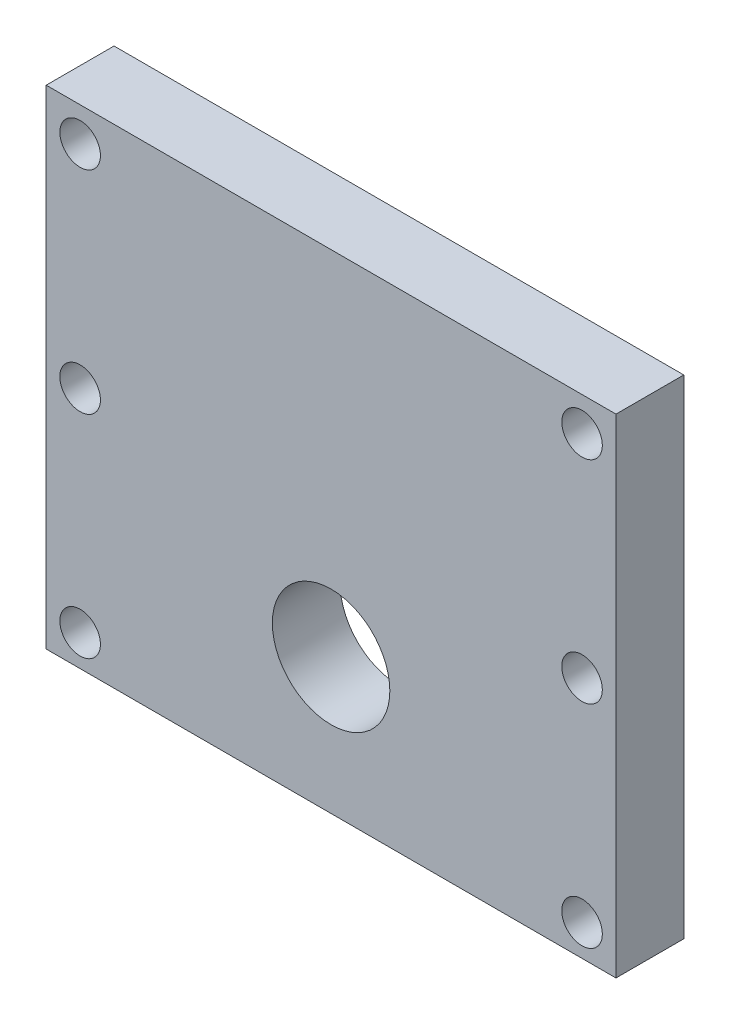
ISO-10303-21;
HEADER;
FILE_DESCRIPTION(('STEP AP214'),'2;1');
FILE_NAME('part.step','',(''),(''),'','','');
FILE_SCHEMA(('AUTOMOTIVE_DESIGN { 1 0 10303 214 1 1 1 1 }'));
ENDSEC;
DATA;
#1=APPLICATION_CONTEXT('core data for automotive mechanical design processes');
#2=APPLICATION_PROTOCOL_DEFINITION('international standard','automotive_design',2000,#1);
#3=PRODUCT_CONTEXT('',#1,'mechanical');
#4=PRODUCT('Part','Part','',(#3));
#5=PRODUCT_RELATED_PRODUCT_CATEGORY('part','',(#4));
#6=PRODUCT_DEFINITION_FORMATION('','',#4);
#7=PRODUCT_DEFINITION_CONTEXT('part definition',#1,'design');
#8=PRODUCT_DEFINITION('design','',#6,#7);
#9=PRODUCT_DEFINITION_SHAPE('','',#8);
#10=(LENGTH_UNIT() NAMED_UNIT(*) SI_UNIT(.MILLI.,.METRE.));
#11=(NAMED_UNIT(*) PLANE_ANGLE_UNIT() SI_UNIT($,.RADIAN.));
#12=(NAMED_UNIT(*) SI_UNIT($,.STERADIAN.) SOLID_ANGLE_UNIT());
#13=UNCERTAINTY_MEASURE_WITH_UNIT(LENGTH_MEASURE(1.E-05),#10,'distance_accuracy_value','');
#14=(GEOMETRIC_REPRESENTATION_CONTEXT(3) GLOBAL_UNCERTAINTY_ASSIGNED_CONTEXT((#13)) GLOBAL_UNIT_ASSIGNED_CONTEXT((#10,
#11,#12)) REPRESENTATION_CONTEXT('',''));
#15=CARTESIAN_POINT('',(0.,0.,0.));
#16=DIRECTION('',(0.,0.,1.));
#17=DIRECTION('',(1.,0.,0.));
#18=AXIS2_PLACEMENT_3D('',#15,#16,#17);
#19=CARTESIAN_POINT('',(0.,0.,6.35));
#20=DIRECTION('',(1.,0.,0.));
#21=DIRECTION('',(0.,0.,-1.));
#22=AXIS2_PLACEMENT_3D('',#19,#20,#21);
#23=PLANE('',#22);
#24=DIRECTION('',(0.,-1.,0.));
#25=VECTOR('',#24,1.);
#26=CARTESIAN_POINT('',(0.,0.,0.));
#27=LINE('',#26,#25);
#28=CARTESIAN_POINT('',(0.,45.72,0.));
#29=VERTEX_POINT('',#28);
#30=CARTESIAN_POINT('',(0.,0.,0.));
#31=VERTEX_POINT('',#30);
#32=EDGE_CURVE('E109',#29,#31,#27,.T.);
#33=ORIENTED_EDGE('',*,*,#32,.T.);
#34=DIRECTION('',(0.,0.,-1.));
#35=VECTOR('',#34,1.);
#36=CARTESIAN_POINT('',(0.,0.,6.35));
#37=LINE('',#36,#35);
#38=CARTESIAN_POINT('',(0.,0.,6.35));
#39=VERTEX_POINT('',#38);
#40=EDGE_CURVE('E11',#39,#31,#37,.T.);
#41=ORIENTED_EDGE('',*,*,#40,.F.);
#42=DIRECTION('',(0.,-1.,0.));
#43=VECTOR('',#42,1.);
#44=CARTESIAN_POINT('',(0.,0.,6.35));
#45=LINE('',#44,#43);
#46=CARTESIAN_POINT('',(0.,45.72,6.35));
#47=VERTEX_POINT('',#46);
#48=EDGE_CURVE('E95',#47,#39,#45,.T.);
#49=ORIENTED_EDGE('',*,*,#48,.F.);
#50=DIRECTION('',(0.,0.,-1.));
#51=VECTOR('',#50,1.);
#52=CARTESIAN_POINT('',(0.,45.72,6.35));
#53=LINE('',#52,#51);
#54=EDGE_CURVE('E105',#47,#29,#53,.T.);
#55=ORIENTED_EDGE('',*,*,#54,.T.);
#56=EDGE_LOOP('',(#33,#41,#49,#55));
#57=FACE_BOUND('',#56,.T.);
#58=ADVANCED_FACE('F40',(#57),#23,.F.);
#59=CARTESIAN_POINT('',(0.,0.,6.35));
#60=DIRECTION('',(0.,1.,0.));
#61=DIRECTION('',(0.,0.,1.));
#62=AXIS2_PLACEMENT_3D('',#59,#60,#61);
#63=PLANE('',#62);
#64=DIRECTION('',(1.,0.,0.));
#65=VECTOR('',#64,1.);
#66=CARTESIAN_POINT('',(0.,0.,0.));
#67=LINE('',#66,#65);
#68=CARTESIAN_POINT('',(53.34,0.,0.));
#69=VERTEX_POINT('',#68);
#70=EDGE_CURVE('E100',#31,#69,#67,.T.);
#71=ORIENTED_EDGE('',*,*,#70,.T.);
#72=DIRECTION('',(0.,0.,-1.));
#73=VECTOR('',#72,1.);
#74=CARTESIAN_POINT('',(53.34,0.,6.35));
#75=LINE('',#74,#73);
#76=CARTESIAN_POINT('',(53.34,0.,6.35));
#77=VERTEX_POINT('',#76);
#78=EDGE_CURVE('E49',#77,#69,#75,.T.);
#79=ORIENTED_EDGE('',*,*,#78,.F.);
#80=DIRECTION('',(1.,0.,0.));
#81=VECTOR('',#80,1.);
#82=CARTESIAN_POINT('',(0.,0.,6.35));
#83=LINE('',#82,#81);
#84=EDGE_CURVE('E90',#39,#77,#83,.T.);
#85=ORIENTED_EDGE('',*,*,#84,.F.);
#86=ORIENTED_EDGE('',*,*,#40,.T.);
#87=EDGE_LOOP('',(#71,#79,#85,#86));
#88=FACE_BOUND('',#87,.T.);
#89=ADVANCED_FACE('F99',(#88),#63,.F.);
#90=CARTESIAN_POINT('',(53.34,0.,6.35));
#91=DIRECTION('',(-1.,0.,0.));
#92=DIRECTION('',(0.,0.,1.));
#93=AXIS2_PLACEMENT_3D('',#90,#91,#92);
#94=PLANE('',#93);
#95=DIRECTION('',(0.,1.,0.));
#96=VECTOR('',#95,1.);
#97=CARTESIAN_POINT('',(53.34,0.,0.));
#98=LINE('',#97,#96);
#99=CARTESIAN_POINT('',(53.34,45.72,0.));
#100=VERTEX_POINT('',#99);
#101=EDGE_CURVE('E75',#69,#100,#98,.T.);
#102=ORIENTED_EDGE('',*,*,#101,.T.);
#103=DIRECTION('',(0.,0.,-1.));
#104=VECTOR('',#103,1.);
#105=CARTESIAN_POINT('',(53.34,45.72,6.35));
#106=LINE('',#105,#104);
#107=CARTESIAN_POINT('',(53.34,45.72,6.35));
#108=VERTEX_POINT('',#107);
#109=EDGE_CURVE('E101',#108,#100,#106,.T.);
#110=ORIENTED_EDGE('',*,*,#109,.F.);
#111=DIRECTION('',(0.,1.,0.));
#112=VECTOR('',#111,1.);
#113=CARTESIAN_POINT('',(53.34,0.,6.35));
#114=LINE('',#113,#112);
#115=EDGE_CURVE('E93',#77,#108,#114,.T.);
#116=ORIENTED_EDGE('',*,*,#115,.F.);
#117=ORIENTED_EDGE('',*,*,#78,.T.);
#118=EDGE_LOOP('',(#102,#110,#116,#117));
#119=FACE_BOUND('',#118,.T.);
#120=ADVANCED_FACE('F102',(#119),#94,.F.);
#121=CARTESIAN_POINT('',(0.,45.72,6.35));
#122=DIRECTION('',(0.,-1.,0.));
#123=DIRECTION('',(0.,0.,-1.));
#124=AXIS2_PLACEMENT_3D('',#121,#122,#123);
#125=PLANE('',#124);
#126=DIRECTION('',(-1.,0.,0.));
#127=VECTOR('',#126,1.);
#128=CARTESIAN_POINT('',(0.,45.72,0.));
#129=LINE('',#128,#127);
#130=EDGE_CURVE('E83',#100,#29,#129,.T.);
#131=ORIENTED_EDGE('',*,*,#130,.T.);
#132=ORIENTED_EDGE('',*,*,#54,.F.);
#133=DIRECTION('',(-1.,0.,0.));
#134=VECTOR('',#133,1.);
#135=CARTESIAN_POINT('',(0.,45.72,6.35));
#136=LINE('',#135,#134);
#137=EDGE_CURVE('E57',#108,#47,#136,.T.);
#138=ORIENTED_EDGE('',*,*,#137,.F.);
#139=ORIENTED_EDGE('',*,*,#109,.T.);
#140=EDGE_LOOP('',(#131,#132,#138,#139));
#141=FACE_BOUND('',#140,.T.);
#142=ADVANCED_FACE('F121',(#141),#125,.F.);
#143=CARTESIAN_POINT('',(0.,0.,6.35));
#144=DIRECTION('',(0.,0.,-1.));
#145=DIRECTION('',(-1.,0.,0.));
#146=AXIS2_PLACEMENT_3D('',#143,#144,#145);
#147=PLANE('',#146);
#148=CARTESIAN_POINT('',(3.175,42.545,6.35));
#149=DIRECTION('',(0.,0.,1.));
#150=DIRECTION('',(1.,0.,0.));
#151=AXIS2_PLACEMENT_3D('',#148,#149,#150);
#152=CIRCLE('',#151,1.89864999999999);
#153=CARTESIAN_POINT('',(5.07364999999998,42.545,6.35));
#154=VERTEX_POINT('',#153);
#155=EDGE_CURVE('E171',#154,#154,#152,.T.);
#156=ORIENTED_EDGE('',*,*,#155,.F.);
#157=EDGE_LOOP('',(#156));
#158=FACE_BOUND('',#157,.T.);
#159=CARTESIAN_POINT('',(50.165,42.545,6.35));
#160=DIRECTION('',(0.,0.,1.));
#161=DIRECTION('',(1.,0.,0.));
#162=AXIS2_PLACEMENT_3D('',#159,#160,#161);
#163=CIRCLE('',#162,1.89864999999999);
#164=CARTESIAN_POINT('',(52.06365,42.545,6.35));
#165=VERTEX_POINT('',#164);
#166=EDGE_CURVE('E164',#165,#165,#163,.T.);
#167=ORIENTED_EDGE('',*,*,#166,.F.);
#168=EDGE_LOOP('',(#167));
#169=FACE_BOUND('',#168,.T.);
#170=CARTESIAN_POINT('',(50.1650000000002,22.733,6.35));
#171=DIRECTION('',(0.,0.,1.));
#172=DIRECTION('',(1.,0.,0.));
#173=AXIS2_PLACEMENT_3D('',#170,#171,#172);
#174=CIRCLE('',#173,1.89864999999999);
#175=CARTESIAN_POINT('',(52.0636500000002,22.733,6.35));
#176=VERTEX_POINT('',#175);
#177=EDGE_CURVE('E158',#176,#176,#174,.T.);
#178=ORIENTED_EDGE('',*,*,#177,.F.);
#179=EDGE_LOOP('',(#178));
#180=FACE_BOUND('',#179,.T.);
#181=CARTESIAN_POINT('',(50.1650000000004,2.921,6.35));
#182=DIRECTION('',(0.,0.,1.));
#183=DIRECTION('',(1.,0.,0.));
#184=AXIS2_PLACEMENT_3D('',#181,#182,#183);
#185=CIRCLE('',#184,1.89864999999999);
#186=CARTESIAN_POINT('',(52.0636500000004,2.921,6.35));
#187=VERTEX_POINT('',#186);
#188=EDGE_CURVE('E152',#187,#187,#185,.T.);
#189=ORIENTED_EDGE('',*,*,#188,.F.);
#190=EDGE_LOOP('',(#189));
#191=FACE_BOUND('',#190,.T.);
#192=CARTESIAN_POINT('',(3.1750000000002,22.733,6.35));
#193=DIRECTION('',(0.,0.,1.));
#194=DIRECTION('',(1.,0.,0.));
#195=AXIS2_PLACEMENT_3D('',#192,#193,#194);
#196=CIRCLE('',#195,1.89864999999999);
#197=CARTESIAN_POINT('',(5.07365000000019,22.733,6.35));
#198=VERTEX_POINT('',#197);
#199=EDGE_CURVE('E146',#198,#198,#196,.T.);
#200=ORIENTED_EDGE('',*,*,#199,.F.);
#201=EDGE_LOOP('',(#200));
#202=FACE_BOUND('',#201,.T.);
#203=CARTESIAN_POINT('',(3.17500000000041,2.921,6.35));
#204=DIRECTION('',(0.,0.,1.));
#205=DIRECTION('',(1.,0.,0.));
#206=AXIS2_PLACEMENT_3D('',#203,#204,#205);
#207=CIRCLE('',#206,1.89864999999999);
#208=CARTESIAN_POINT('',(5.0736500000004,2.921,6.35));
#209=VERTEX_POINT('',#208);
#210=EDGE_CURVE('E139',#209,#209,#207,.T.);
#211=ORIENTED_EDGE('',*,*,#210,.F.);
#212=EDGE_LOOP('',(#211));
#213=FACE_BOUND('',#212,.T.);
#214=CARTESIAN_POINT('',(26.67,12.7,6.35));
#215=DIRECTION('',(0.,0.,-1.));
#216=DIRECTION('',(-1.,0.,0.));
#217=AXIS2_PLACEMENT_3D('',#214,#215,#216);
#218=CIRCLE('',#217,5.49999999999999);
#219=CARTESIAN_POINT('',(21.17,12.7,6.35));
#220=VERTEX_POINT('',#219);
#221=EDGE_CURVE('E113',#220,#220,#218,.T.);
#222=ORIENTED_EDGE('',*,*,#221,.T.);
#223=EDGE_LOOP('',(#222));
#224=FACE_BOUND('',#223,.T.);
#225=ORIENTED_EDGE('',*,*,#48,.T.);
#226=ORIENTED_EDGE('',*,*,#84,.T.);
#227=ORIENTED_EDGE('',*,*,#115,.T.);
#228=ORIENTED_EDGE('',*,*,#137,.T.);
#229=EDGE_LOOP('',(#225,#226,#227,#228));
#230=FACE_BOUND('',#229,.T.);
#231=ADVANCED_FACE('F91',(#158,#169,#180,#191,#202,#213,#224,#230),#147,.F.);
#232=CARTESIAN_POINT('',(0.,0.,0.));
#233=DIRECTION('',(0.,0.,-1.));
#234=DIRECTION('',(-1.,0.,0.));
#235=AXIS2_PLACEMENT_3D('',#232,#233,#234);
#236=PLANE('',#235);
#237=CARTESIAN_POINT('',(3.175,42.545,0.));
#238=DIRECTION('',(0.,0.,-1.));
#239=DIRECTION('',(-1.,0.,0.));
#240=AXIS2_PLACEMENT_3D('',#237,#238,#239);
#241=CIRCLE('',#240,1.89864999999999);
#242=CARTESIAN_POINT('',(1.27635,42.545,0.));
#243=VERTEX_POINT('',#242);
#244=EDGE_CURVE('E167',#243,#243,#241,.T.);
#245=ORIENTED_EDGE('',*,*,#244,.F.);
#246=EDGE_LOOP('',(#245));
#247=FACE_BOUND('',#246,.T.);
#248=CARTESIAN_POINT('',(50.165,42.545,0.));
#249=DIRECTION('',(0.,0.,-1.));
#250=DIRECTION('',(-1.,0.,0.));
#251=AXIS2_PLACEMENT_3D('',#248,#249,#250);
#252=CIRCLE('',#251,1.89864999999999);
#253=CARTESIAN_POINT('',(48.26635,42.545,0.));
#254=VERTEX_POINT('',#253);
#255=EDGE_CURVE('E161',#254,#254,#252,.T.);
#256=ORIENTED_EDGE('',*,*,#255,.F.);
#257=EDGE_LOOP('',(#256));
#258=FACE_BOUND('',#257,.T.);
#259=CARTESIAN_POINT('',(50.1650000000002,22.733,0.));
#260=DIRECTION('',(0.,0.,-1.));
#261=DIRECTION('',(-1.,0.,0.));
#262=AXIS2_PLACEMENT_3D('',#259,#260,#261);
#263=CIRCLE('',#262,1.89864999999999);
#264=CARTESIAN_POINT('',(48.2663500000002,22.733,0.));
#265=VERTEX_POINT('',#264);
#266=EDGE_CURVE('E155',#265,#265,#263,.T.);
#267=ORIENTED_EDGE('',*,*,#266,.F.);
#268=EDGE_LOOP('',(#267));
#269=FACE_BOUND('',#268,.T.);
#270=CARTESIAN_POINT('',(50.1650000000004,2.921,0.));
#271=DIRECTION('',(0.,0.,-1.));
#272=DIRECTION('',(-1.,0.,0.));
#273=AXIS2_PLACEMENT_3D('',#270,#271,#272);
#274=CIRCLE('',#273,1.89864999999999);
#275=CARTESIAN_POINT('',(48.2663500000004,2.921,0.));
#276=VERTEX_POINT('',#275);
#277=EDGE_CURVE('E149',#276,#276,#274,.T.);
#278=ORIENTED_EDGE('',*,*,#277,.F.);
#279=EDGE_LOOP('',(#278));
#280=FACE_BOUND('',#279,.T.);
#281=CARTESIAN_POINT('',(3.1750000000002,22.733,0.));
#282=DIRECTION('',(0.,0.,-1.));
#283=DIRECTION('',(-1.,0.,0.));
#284=AXIS2_PLACEMENT_3D('',#281,#282,#283);
#285=CIRCLE('',#284,1.89864999999999);
#286=CARTESIAN_POINT('',(1.27635000000021,22.733,0.));
#287=VERTEX_POINT('',#286);
#288=EDGE_CURVE('E142',#287,#287,#285,.T.);
#289=ORIENTED_EDGE('',*,*,#288,.F.);
#290=EDGE_LOOP('',(#289));
#291=FACE_BOUND('',#290,.T.);
#292=CARTESIAN_POINT('',(3.17500000000041,2.921,0.));
#293=DIRECTION('',(0.,0.,-1.));
#294=DIRECTION('',(-1.,0.,0.));
#295=AXIS2_PLACEMENT_3D('',#292,#293,#294);
#296=CIRCLE('',#295,1.89864999999999);
#297=CARTESIAN_POINT('',(1.27635000000042,2.921,0.));
#298=VERTEX_POINT('',#297);
#299=EDGE_CURVE('E135',#298,#298,#296,.T.);
#300=ORIENTED_EDGE('',*,*,#299,.F.);
#301=EDGE_LOOP('',(#300));
#302=FACE_BOUND('',#301,.T.);
#303=CARTESIAN_POINT('',(26.67,12.7,0.));
#304=DIRECTION('',(0.,0.,1.));
#305=DIRECTION('',(1.,0.,0.));
#306=AXIS2_PLACEMENT_3D('',#303,#304,#305);
#307=CIRCLE('',#306,5.49999999999999);
#308=CARTESIAN_POINT('',(32.17,12.7,0.));
#309=VERTEX_POINT('',#308);
#310=EDGE_CURVE('E132',#309,#309,#307,.T.);
#311=ORIENTED_EDGE('',*,*,#310,.T.);
#312=EDGE_LOOP('',(#311));
#313=FACE_BOUND('',#312,.T.);
#314=ORIENTED_EDGE('',*,*,#32,.F.);
#315=ORIENTED_EDGE('',*,*,#130,.F.);
#316=ORIENTED_EDGE('',*,*,#101,.F.);
#317=ORIENTED_EDGE('',*,*,#70,.F.);
#318=EDGE_LOOP('',(#314,#315,#316,#317));
#319=FACE_BOUND('',#318,.T.);
#320=ADVANCED_FACE('F124',(#247,#258,#269,#280,#291,#302,#313,#319),#236,.T.);
#321=CARTESIAN_POINT('',(26.67,12.7,0.));
#322=DIRECTION('',(0.,0.,1.));
#323=DIRECTION('',(1.,0.,0.));
#324=AXIS2_PLACEMENT_3D('',#321,#322,#323);
#325=CYLINDRICAL_SURFACE('',#324,5.49999999999999);
#326=ORIENTED_EDGE('',*,*,#310,.F.);
#327=EDGE_LOOP('',(#326));
#328=FACE_BOUND('',#327,.T.);
#329=ORIENTED_EDGE('',*,*,#221,.F.);
#330=EDGE_LOOP('',(#329));
#331=FACE_BOUND('',#330,.T.);
#332=ADVANCED_FACE('F194',(#328,#331),#325,.F.);
#333=CARTESIAN_POINT('',(3.17500000000041,2.921,6.35));
#334=DIRECTION('',(0.,0.,1.));
#335=DIRECTION('',(1.,0.,0.));
#336=AXIS2_PLACEMENT_3D('',#333,#334,#335);
#337=CYLINDRICAL_SURFACE('',#336,1.89864999999999);
#338=ORIENTED_EDGE('',*,*,#210,.T.);
#339=EDGE_LOOP('',(#338));
#340=FACE_BOUND('',#339,.T.);
#341=ORIENTED_EDGE('',*,*,#299,.T.);
#342=EDGE_LOOP('',(#341));
#343=FACE_BOUND('',#342,.T.);
#344=ADVANCED_FACE('F196',(#340,#343),#337,.F.);
#345=CARTESIAN_POINT('',(3.1750000000002,22.733,6.35));
#346=DIRECTION('',(0.,0.,1.));
#347=DIRECTION('',(1.,0.,0.));
#348=AXIS2_PLACEMENT_3D('',#345,#346,#347);
#349=CYLINDRICAL_SURFACE('',#348,1.89864999999999);
#350=ORIENTED_EDGE('',*,*,#199,.T.);
#351=EDGE_LOOP('',(#350));
#352=FACE_BOUND('',#351,.T.);
#353=ORIENTED_EDGE('',*,*,#288,.T.);
#354=EDGE_LOOP('',(#353));
#355=FACE_BOUND('',#354,.T.);
#356=ADVANCED_FACE('F203',(#352,#355),#349,.F.);
#357=CARTESIAN_POINT('',(50.1650000000004,2.921,6.35));
#358=DIRECTION('',(0.,0.,1.));
#359=DIRECTION('',(1.,0.,0.));
#360=AXIS2_PLACEMENT_3D('',#357,#358,#359);
#361=CYLINDRICAL_SURFACE('',#360,1.89864999999999);
#362=ORIENTED_EDGE('',*,*,#188,.T.);
#363=EDGE_LOOP('',(#362));
#364=FACE_BOUND('',#363,.T.);
#365=ORIENTED_EDGE('',*,*,#277,.T.);
#366=EDGE_LOOP('',(#365));
#367=FACE_BOUND('',#366,.T.);
#368=ADVANCED_FACE('F237',(#364,#367),#361,.F.);
#369=CARTESIAN_POINT('',(50.1650000000002,22.733,6.35));
#370=DIRECTION('',(0.,0.,1.));
#371=DIRECTION('',(1.,0.,0.));
#372=AXIS2_PLACEMENT_3D('',#369,#370,#371);
#373=CYLINDRICAL_SURFACE('',#372,1.89864999999999);
#374=ORIENTED_EDGE('',*,*,#177,.T.);
#375=EDGE_LOOP('',(#374));
#376=FACE_BOUND('',#375,.T.);
#377=ORIENTED_EDGE('',*,*,#266,.T.);
#378=EDGE_LOOP('',(#377));
#379=FACE_BOUND('',#378,.T.);
#380=ADVANCED_FACE('F280',(#376,#379),#373,.F.);
#381=CARTESIAN_POINT('',(50.165,42.545,6.35));
#382=DIRECTION('',(0.,0.,1.));
#383=DIRECTION('',(1.,0.,0.));
#384=AXIS2_PLACEMENT_3D('',#381,#382,#383);
#385=CYLINDRICAL_SURFACE('',#384,1.89864999999999);
#386=ORIENTED_EDGE('',*,*,#166,.T.);
#387=EDGE_LOOP('',(#386));
#388=FACE_BOUND('',#387,.T.);
#389=ORIENTED_EDGE('',*,*,#255,.T.);
#390=EDGE_LOOP('',(#389));
#391=FACE_BOUND('',#390,.T.);
#392=ADVANCED_FACE('F289',(#388,#391),#385,.F.);
#393=CARTESIAN_POINT('',(3.175,42.545,6.35));
#394=DIRECTION('',(0.,0.,1.));
#395=DIRECTION('',(1.,0.,0.));
#396=AXIS2_PLACEMENT_3D('',#393,#394,#395);
#397=CYLINDRICAL_SURFACE('',#396,1.89864999999999);
#398=ORIENTED_EDGE('',*,*,#155,.T.);
#399=EDGE_LOOP('',(#398));
#400=FACE_BOUND('',#399,.T.);
#401=ORIENTED_EDGE('',*,*,#244,.T.);
#402=EDGE_LOOP('',(#401));
#403=FACE_BOUND('',#402,.T.);
#404=ADVANCED_FACE('F176',(#400,#403),#397,.F.);
#405=CLOSED_SHELL('',(#58,#89,#120,#142,#231,#320,#332,#344,#356,#368,#380,#392,#404));
#406=MANIFOLD_SOLID_BREP('B2',#405);
#407=ADVANCED_BREP_SHAPE_REPRESENTATION('',(#18,#406),#14);
#408=SHAPE_DEFINITION_REPRESENTATION(#9,#407);
ENDSEC;
END-ISO-10303-21;
